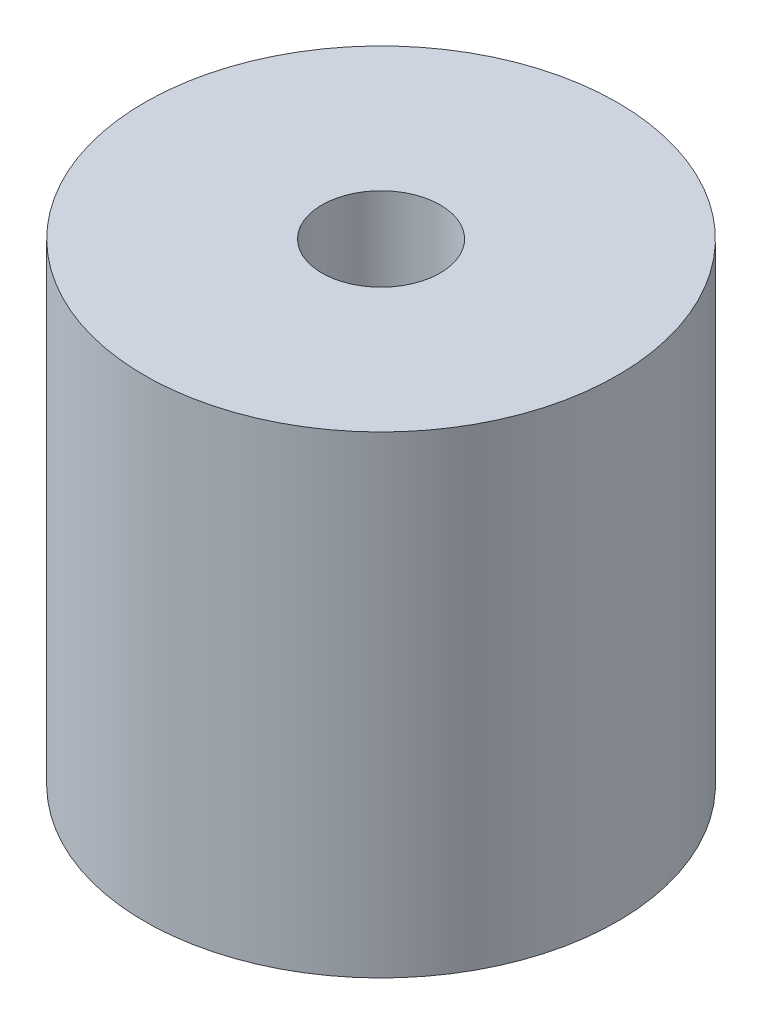
ISO-10303-21;
HEADER;
FILE_DESCRIPTION(('STEP AP214'),'2;1');
FILE_NAME('part.step','',(''),(''),'','','');
FILE_SCHEMA(('AUTOMOTIVE_DESIGN { 1 0 10303 214 1 1 1 1 }'));
ENDSEC;
DATA;
#1=APPLICATION_CONTEXT('core data for automotive mechanical design processes');
#2=APPLICATION_PROTOCOL_DEFINITION('international standard','automotive_design',2000,#1);
#3=PRODUCT_CONTEXT('',#1,'mechanical');
#4=PRODUCT('Part','Part','',(#3));
#5=PRODUCT_RELATED_PRODUCT_CATEGORY('part','',(#4));
#6=PRODUCT_DEFINITION_FORMATION('','',#4);
#7=PRODUCT_DEFINITION_CONTEXT('part definition',#1,'design');
#8=PRODUCT_DEFINITION('design','',#6,#7);
#9=PRODUCT_DEFINITION_SHAPE('','',#8);
#10=(LENGTH_UNIT() NAMED_UNIT(*) SI_UNIT(.MILLI.,.METRE.));
#11=(NAMED_UNIT(*) PLANE_ANGLE_UNIT() SI_UNIT($,.RADIAN.));
#12=(NAMED_UNIT(*) SI_UNIT($,.STERADIAN.) SOLID_ANGLE_UNIT());
#13=UNCERTAINTY_MEASURE_WITH_UNIT(LENGTH_MEASURE(1.E-05),#10,'distance_accuracy_value','');
#14=(GEOMETRIC_REPRESENTATION_CONTEXT(3) GLOBAL_UNCERTAINTY_ASSIGNED_CONTEXT((#13)) GLOBAL_UNIT_ASSIGNED_CONTEXT((#10,
#11,#12)) REPRESENTATION_CONTEXT('',''));
#15=CARTESIAN_POINT('',(0.,0.,0.));
#16=DIRECTION('',(0.,0.,1.));
#17=DIRECTION('',(1.,0.,0.));
#18=AXIS2_PLACEMENT_3D('',#15,#16,#17);
#19=CARTESIAN_POINT('',(2.5,20.,0.));
#20=DIRECTION('',(0.,1.,0.));
#21=DIRECTION('',(0.,0.,1.));
#22=AXIS2_PLACEMENT_3D('',#19,#20,#21);
#23=PLANE('',#22);
#24=CARTESIAN_POINT('',(0.,20.,0.));
#25=DIRECTION('',(0.,-1.,0.));
#26=DIRECTION('',(0.,0.,-1.));
#27=AXIS2_PLACEMENT_3D('',#24,#25,#26);
#28=CIRCLE('',#27,2.5);
#29=CARTESIAN_POINT('',(0.,20.,-2.5));
#30=VERTEX_POINT('',#29);
#31=EDGE_CURVE('E70',#30,#30,#28,.T.);
#32=ORIENTED_EDGE('',*,*,#31,.T.);
#33=EDGE_LOOP('',(#32));
#34=FACE_BOUND('',#33,.T.);
#35=CARTESIAN_POINT('',(0.,20.,0.));
#36=DIRECTION('',(0.,-1.,0.));
#37=DIRECTION('',(0.,0.,-1.));
#38=AXIS2_PLACEMENT_3D('',#35,#36,#37);
#39=CIRCLE('',#38,10.);
#40=CARTESIAN_POINT('',(0.,20.,-10.));
#41=VERTEX_POINT('',#40);
#42=EDGE_CURVE('E10',#41,#41,#39,.T.);
#43=ORIENTED_EDGE('',*,*,#42,.F.);
#44=EDGE_LOOP('',(#43));
#45=FACE_BOUND('',#44,.T.);
#46=ADVANCED_FACE('F43',(#34,#45),#23,.T.);
#47=CARTESIAN_POINT('',(0.,0.,0.));
#48=DIRECTION('',(0.,-1.,0.));
#49=DIRECTION('',(0.,0.,-1.));
#50=AXIS2_PLACEMENT_3D('',#47,#48,#49);
#51=CYLINDRICAL_SURFACE('',#50,10.);
#52=ORIENTED_EDGE('',*,*,#42,.T.);
#53=EDGE_LOOP('',(#52));
#54=FACE_BOUND('',#53,.T.);
#55=CARTESIAN_POINT('',(0.,0.,0.));
#56=DIRECTION('',(0.,-1.,0.));
#57=DIRECTION('',(0.,0.,-1.));
#58=AXIS2_PLACEMENT_3D('',#55,#56,#57);
#59=CIRCLE('',#58,10.);
#60=CARTESIAN_POINT('',(0.,0.,-10.));
#61=VERTEX_POINT('',#60);
#62=EDGE_CURVE('E50',#61,#61,#59,.T.);
#63=ORIENTED_EDGE('',*,*,#62,.F.);
#64=EDGE_LOOP('',(#63));
#65=FACE_BOUND('',#64,.T.);
#66=ADVANCED_FACE('F89',(#54,#65),#51,.T.);
#67=CARTESIAN_POINT('',(10.,0.,0.));
#68=DIRECTION('',(0.,-1.,0.));
#69=DIRECTION('',(0.,0.,-1.));
#70=AXIS2_PLACEMENT_3D('',#67,#68,#69);
#71=PLANE('',#70);
#72=ORIENTED_EDGE('',*,*,#62,.T.);
#73=EDGE_LOOP('',(#72));
#74=FACE_BOUND('',#73,.T.);
#75=CARTESIAN_POINT('',(0.,0.,0.));
#76=DIRECTION('',(0.,-1.,0.));
#77=DIRECTION('',(0.,0.,-1.));
#78=AXIS2_PLACEMENT_3D('',#75,#76,#77);
#79=CIRCLE('',#78,3.);
#80=CARTESIAN_POINT('',(0.,0.,-3.));
#81=VERTEX_POINT('',#80);
#82=EDGE_CURVE('E55',#81,#81,#79,.T.);
#83=ORIENTED_EDGE('',*,*,#82,.F.);
#84=EDGE_LOOP('',(#83));
#85=FACE_BOUND('',#84,.T.);
#86=ADVANCED_FACE('F93',(#74,#85),#71,.T.);
#87=CARTESIAN_POINT('',(0.,0.,0.));
#88=DIRECTION('',(0.,-1.,0.));
#89=DIRECTION('',(0.,0.,-1.));
#90=AXIS2_PLACEMENT_3D('',#87,#88,#89);
#91=CYLINDRICAL_SURFACE('',#90,3.);
#92=ORIENTED_EDGE('',*,*,#82,.T.);
#93=EDGE_LOOP('',(#92));
#94=FACE_BOUND('',#93,.T.);
#95=CARTESIAN_POINT('',(0.,10.,0.));
#96=DIRECTION('',(0.,-1.,0.));
#97=DIRECTION('',(0.,0.,-1.));
#98=AXIS2_PLACEMENT_3D('',#95,#96,#97);
#99=CIRCLE('',#98,3.);
#100=CARTESIAN_POINT('',(0.,10.,-3.));
#101=VERTEX_POINT('',#100);
#102=EDGE_CURVE('E60',#101,#101,#99,.T.);
#103=ORIENTED_EDGE('',*,*,#102,.F.);
#104=EDGE_LOOP('',(#103));
#105=FACE_BOUND('',#104,.T.);
#106=ADVANCED_FACE('F85',(#94,#105),#91,.F.);
#107=CARTESIAN_POINT('',(3.,10.,0.));
#108=DIRECTION('',(0.,-1.,0.));
#109=DIRECTION('',(0.,0.,-1.));
#110=AXIS2_PLACEMENT_3D('',#107,#108,#109);
#111=PLANE('',#110);
#112=ORIENTED_EDGE('',*,*,#102,.T.);
#113=EDGE_LOOP('',(#112));
#114=FACE_BOUND('',#113,.T.);
#115=CARTESIAN_POINT('',(0.,10.,0.));
#116=DIRECTION('',(0.,-1.,0.));
#117=DIRECTION('',(0.,0.,-1.));
#118=AXIS2_PLACEMENT_3D('',#115,#116,#117);
#119=CIRCLE('',#118,2.5);
#120=CARTESIAN_POINT('',(0.,10.,-2.5));
#121=VERTEX_POINT('',#120);
#122=EDGE_CURVE('E66',#121,#121,#119,.T.);
#123=ORIENTED_EDGE('',*,*,#122,.F.);
#124=EDGE_LOOP('',(#123));
#125=FACE_BOUND('',#124,.T.);
#126=ADVANCED_FACE('F79',(#114,#125),#111,.T.);
#127=CARTESIAN_POINT('',(0.,0.,0.));
#128=DIRECTION('',(0.,-1.,0.));
#129=DIRECTION('',(0.,0.,-1.));
#130=AXIS2_PLACEMENT_3D('',#127,#128,#129);
#131=CYLINDRICAL_SURFACE('',#130,2.5);
#132=ORIENTED_EDGE('',*,*,#122,.T.);
#133=EDGE_LOOP('',(#132));
#134=FACE_BOUND('',#133,.T.);
#135=ORIENTED_EDGE('',*,*,#31,.F.);
#136=EDGE_LOOP('',(#135));
#137=FACE_BOUND('',#136,.T.);
#138=ADVANCED_FACE('F77',(#134,#137),#131,.F.);
#139=CLOSED_SHELL('',(#46,#66,#86,#106,#126,#138));
#140=MANIFOLD_SOLID_BREP('B2',#139);
#141=ADVANCED_BREP_SHAPE_REPRESENTATION('',(#18,#140),#14);
#142=SHAPE_DEFINITION_REPRESENTATION(#9,#141);
ENDSEC;
END-ISO-10303-21;
